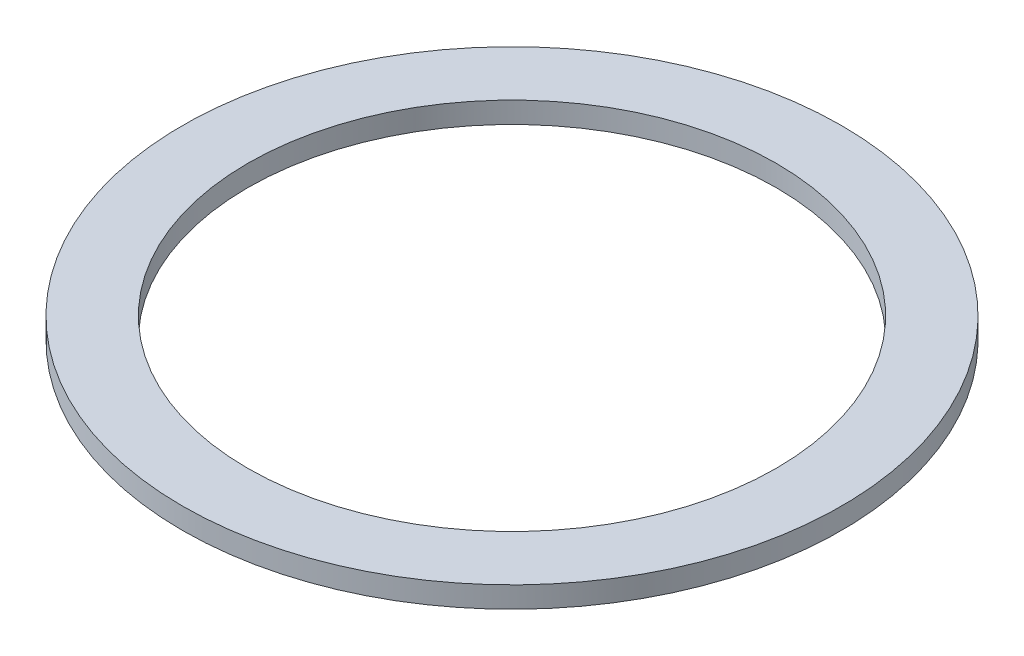
ISO-10303-21;
HEADER;
FILE_DESCRIPTION(('STEP AP214'),'2;1');
FILE_NAME('part.step','',(''),(''),'','','');
FILE_SCHEMA(('AUTOMOTIVE_DESIGN { 1 0 10303 214 1 1 1 1 }'));
ENDSEC;
DATA;
#1=APPLICATION_CONTEXT('core data for automotive mechanical design processes');
#2=APPLICATION_PROTOCOL_DEFINITION('international standard','automotive_design',2000,#1);
#3=PRODUCT_CONTEXT('',#1,'mechanical');
#4=PRODUCT('Part','Part','',(#3));
#5=PRODUCT_RELATED_PRODUCT_CATEGORY('part','',(#4));
#6=PRODUCT_DEFINITION_FORMATION('','',#4);
#7=PRODUCT_DEFINITION_CONTEXT('part definition',#1,'design');
#8=PRODUCT_DEFINITION('design','',#6,#7);
#9=PRODUCT_DEFINITION_SHAPE('','',#8);
#10=(LENGTH_UNIT() NAMED_UNIT(*) SI_UNIT(.MILLI.,.METRE.));
#11=(NAMED_UNIT(*) PLANE_ANGLE_UNIT() SI_UNIT($,.RADIAN.));
#12=(NAMED_UNIT(*) SI_UNIT($,.STERADIAN.) SOLID_ANGLE_UNIT());
#13=UNCERTAINTY_MEASURE_WITH_UNIT(LENGTH_MEASURE(1.E-05),#10,'distance_accuracy_value','');
#14=(GEOMETRIC_REPRESENTATION_CONTEXT(3) GLOBAL_UNCERTAINTY_ASSIGNED_CONTEXT((#13)) GLOBAL_UNIT_ASSIGNED_CONTEXT((#10,
#11,#12)) REPRESENTATION_CONTEXT('',''));
#15=CARTESIAN_POINT('',(0.,0.,0.));
#16=DIRECTION('',(0.,0.,1.));
#17=DIRECTION('',(1.,0.,0.));
#18=AXIS2_PLACEMENT_3D('',#15,#16,#17);
#19=CARTESIAN_POINT('',(0.,3.175,0.));
#20=DIRECTION('',(0.,1.,0.));
#21=DIRECTION('',(0.,0.,1.));
#22=AXIS2_PLACEMENT_3D('',#19,#20,#21);
#23=PLANE('',#22);
#24=CARTESIAN_POINT('',(0.,3.175,0.));
#25=DIRECTION('',(0.,1.,0.));
#26=DIRECTION('',(0.,0.,1.));
#27=AXIS2_PLACEMENT_3D('',#24,#25,#26);
#28=CIRCLE('',#27,49.5046);
#29=CARTESIAN_POINT('',(0.,3.175,49.5046));
#30=VERTEX_POINT('',#29);
#31=EDGE_CURVE('E10',#30,#30,#28,.T.);
#32=ORIENTED_EDGE('',*,*,#31,.T.);
#33=EDGE_LOOP('',(#32));
#34=FACE_BOUND('',#33,.T.);
#35=CARTESIAN_POINT('',(0.,3.175,0.));
#36=DIRECTION('',(0.,1.,0.));
#37=DIRECTION('',(0.,0.,1.));
#38=AXIS2_PLACEMENT_3D('',#35,#36,#37);
#39=CIRCLE('',#38,39.6875);
#40=CARTESIAN_POINT('',(0.,3.175,39.6875));
#41=VERTEX_POINT('',#40);
#42=EDGE_CURVE('E52',#41,#41,#39,.T.);
#43=ORIENTED_EDGE('',*,*,#42,.F.);
#44=EDGE_LOOP('',(#43));
#45=FACE_BOUND('',#44,.T.);
#46=ADVANCED_FACE('F41',(#34,#45),#23,.T.);
#47=CARTESIAN_POINT('',(0.,0.,0.));
#48=DIRECTION('',(0.,1.,0.));
#49=DIRECTION('',(0.,0.,1.));
#50=AXIS2_PLACEMENT_3D('',#47,#48,#49);
#51=PLANE('',#50);
#52=CARTESIAN_POINT('',(0.,0.,0.));
#53=DIRECTION('',(0.,1.,0.));
#54=DIRECTION('',(0.,0.,1.));
#55=AXIS2_PLACEMENT_3D('',#52,#53,#54);
#56=CIRCLE('',#55,49.5046);
#57=CARTESIAN_POINT('',(0.,0.,49.5046));
#58=VERTEX_POINT('',#57);
#59=EDGE_CURVE('E45',#58,#58,#56,.T.);
#60=ORIENTED_EDGE('',*,*,#59,.F.);
#61=EDGE_LOOP('',(#60));
#62=FACE_BOUND('',#61,.T.);
#63=CARTESIAN_POINT('',(0.,0.,0.));
#64=DIRECTION('',(0.,1.,0.));
#65=DIRECTION('',(0.,0.,1.));
#66=AXIS2_PLACEMENT_3D('',#63,#64,#65);
#67=CIRCLE('',#66,39.6875);
#68=CARTESIAN_POINT('',(0.,0.,39.6875));
#69=VERTEX_POINT('',#68);
#70=EDGE_CURVE('E54',#69,#69,#67,.T.);
#71=ORIENTED_EDGE('',*,*,#70,.T.);
#72=EDGE_LOOP('',(#71));
#73=FACE_BOUND('',#72,.T.);
#74=ADVANCED_FACE('F64',(#62,#73),#51,.F.);
#75=CARTESIAN_POINT('',(0.,3.175,0.));
#76=DIRECTION('',(0.,-1.,0.));
#77=DIRECTION('',(0.,0.,-1.));
#78=AXIS2_PLACEMENT_3D('',#75,#76,#77);
#79=CYLINDRICAL_SURFACE('',#78,49.5046);
#80=ORIENTED_EDGE('',*,*,#31,.F.);
#81=EDGE_LOOP('',(#80));
#82=FACE_BOUND('',#81,.T.);
#83=ORIENTED_EDGE('',*,*,#59,.T.);
#84=EDGE_LOOP('',(#83));
#85=FACE_BOUND('',#84,.T.);
#86=ADVANCED_FACE('F43',(#82,#85),#79,.T.);
#87=CARTESIAN_POINT('',(0.,3.175,0.));
#88=DIRECTION('',(0.,-1.,0.));
#89=DIRECTION('',(0.,0.,-1.));
#90=AXIS2_PLACEMENT_3D('',#87,#88,#89);
#91=CYLINDRICAL_SURFACE('',#90,39.6875);
#92=ORIENTED_EDGE('',*,*,#42,.T.);
#93=EDGE_LOOP('',(#92));
#94=FACE_BOUND('',#93,.T.);
#95=ORIENTED_EDGE('',*,*,#70,.F.);
#96=EDGE_LOOP('',(#95));
#97=FACE_BOUND('',#96,.T.);
#98=ADVANCED_FACE('F60',(#94,#97),#91,.F.);
#99=CLOSED_SHELL('',(#46,#74,#86,#98));
#100=MANIFOLD_SOLID_BREP('B2',#99);
#101=ADVANCED_BREP_SHAPE_REPRESENTATION('',(#18,#100),#14);
#102=SHAPE_DEFINITION_REPRESENTATION(#9,#101);
ENDSEC;
END-ISO-10303-21;
